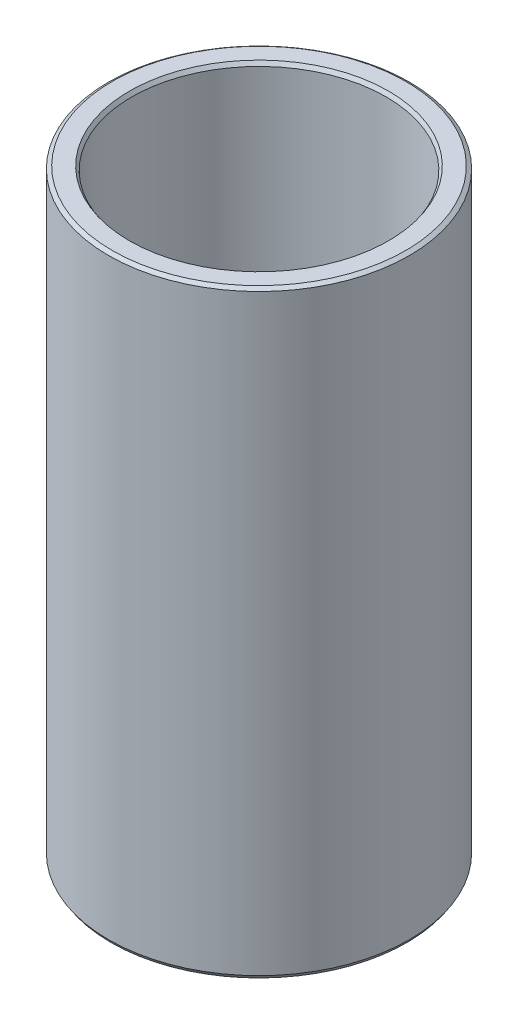
ISO-10303-21;
HEADER;
FILE_DESCRIPTION(('STEP AP214'),'2;1');
FILE_NAME('part.step','',(''),(''),'','','');
FILE_SCHEMA(('AUTOMOTIVE_DESIGN { 1 0 10303 214 1 1 1 1 }'));
ENDSEC;
DATA;
#1=APPLICATION_CONTEXT('core data for automotive mechanical design processes');
#2=APPLICATION_PROTOCOL_DEFINITION('international standard','automotive_design',2000,#1);
#3=PRODUCT_CONTEXT('',#1,'mechanical');
#4=PRODUCT('Part','Part','',(#3));
#5=PRODUCT_RELATED_PRODUCT_CATEGORY('part','',(#4));
#6=PRODUCT_DEFINITION_FORMATION('','',#4);
#7=PRODUCT_DEFINITION_CONTEXT('part definition',#1,'design');
#8=PRODUCT_DEFINITION('design','',#6,#7);
#9=PRODUCT_DEFINITION_SHAPE('','',#8);
#10=(LENGTH_UNIT() NAMED_UNIT(*) SI_UNIT(.MILLI.,.METRE.));
#11=(NAMED_UNIT(*) PLANE_ANGLE_UNIT() SI_UNIT($,.RADIAN.));
#12=(NAMED_UNIT(*) SI_UNIT($,.STERADIAN.) SOLID_ANGLE_UNIT());
#13=UNCERTAINTY_MEASURE_WITH_UNIT(LENGTH_MEASURE(1.E-05),#10,'distance_accuracy_value','');
#14=(GEOMETRIC_REPRESENTATION_CONTEXT(3) GLOBAL_UNCERTAINTY_ASSIGNED_CONTEXT((#13)) GLOBAL_UNIT_ASSIGNED_CONTEXT((#10,
#11,#12)) REPRESENTATION_CONTEXT('',''));
#15=CARTESIAN_POINT('',(0.,0.,0.));
#16=DIRECTION('',(0.,0.,1.));
#17=DIRECTION('',(1.,0.,0.));
#18=AXIS2_PLACEMENT_3D('',#15,#16,#17);
#19=CARTESIAN_POINT('',(0.,238.885693284538,0.));
#20=DIRECTION('',(0.,-1.,0.));
#21=DIRECTION('',(0.,0.,-1.));
#22=AXIS2_PLACEMENT_3D('',#19,#20,#21);
#23=CYLINDRICAL_SURFACE('',#22,60.);
#24=CARTESIAN_POINT('',(0.,1.49715635939934,0.));
#25=DIRECTION('',(0.,1.,0.));
#26=DIRECTION('',(0.,0.,1.));
#27=AXIS2_PLACEMENT_3D('',#24,#25,#26);
#28=CIRCLE('',#27,60.);
#29=CARTESIAN_POINT('',(0.,1.49715635939934,60.));
#30=VERTEX_POINT('',#29);
#31=EDGE_CURVE('E10',#30,#30,#28,.T.);
#32=ORIENTED_EDGE('',*,*,#31,.T.);
#33=EDGE_LOOP('',(#32));
#34=FACE_BOUND('',#33,.T.);
#35=CARTESIAN_POINT('',(0.,237.907163417209,0.));
#36=DIRECTION('',(0.,1.,0.));
#37=DIRECTION('',(0.,0.,1.));
#38=AXIS2_PLACEMENT_3D('',#35,#36,#37);
#39=CIRCLE('',#38,60.);
#40=CARTESIAN_POINT('',(0.,237.907163417209,60.));
#41=VERTEX_POINT('',#40);
#42=EDGE_CURVE('E50',#41,#41,#39,.F.);
#43=ORIENTED_EDGE('',*,*,#42,.T.);
#44=EDGE_LOOP('',(#43));
#45=FACE_BOUND('',#44,.T.);
#46=ADVANCED_FACE('F39',(#34,#45),#23,.T.);
#47=CARTESIAN_POINT('',(0.,238.885693284538,0.));
#48=DIRECTION('',(0.,1.,0.));
#49=DIRECTION('',(0.,0.,1.));
#50=AXIS2_PLACEMENT_3D('',#47,#48,#49);
#51=PLANE('',#50);
#52=CARTESIAN_POINT('',(0.,238.885693284538,0.));
#53=DIRECTION('',(0.,1.,0.));
#54=DIRECTION('',(0.,0.,1.));
#55=AXIS2_PLACEMENT_3D('',#52,#53,#54);
#56=CIRCLE('',#55,51.731943656874);
#57=CARTESIAN_POINT('',(0.,238.885693284538,51.731943656874));
#58=VERTEX_POINT('',#57);
#59=EDGE_CURVE('E58',#58,#58,#56,.F.);
#60=ORIENTED_EDGE('',*,*,#59,.T.);
#61=EDGE_LOOP('',(#60));
#62=FACE_BOUND('',#61,.T.);
#63=CARTESIAN_POINT('',(0.,238.885693284538,0.));
#64=DIRECTION('',(0.,1.,0.));
#65=DIRECTION('',(0.,0.,1.));
#66=AXIS2_PLACEMENT_3D('',#63,#64,#65);
#67=CIRCLE('',#66,58.5028436406007);
#68=CARTESIAN_POINT('',(0.,238.885693284538,58.5028436406007));
#69=VERTEX_POINT('',#68);
#70=EDGE_CURVE('E61',#69,#69,#67,.T.);
#71=ORIENTED_EDGE('',*,*,#70,.T.);
#72=EDGE_LOOP('',(#71));
#73=FACE_BOUND('',#72,.T.);
#74=ADVANCED_FACE('F88',(#62,#73),#51,.T.);
#75=CARTESIAN_POINT('',(0.,0.,0.));
#76=DIRECTION('',(0.,1.,0.));
#77=DIRECTION('',(0.,0.,1.));
#78=AXIS2_PLACEMENT_3D('',#75,#76,#77);
#79=PLANE('',#78);
#80=CARTESIAN_POINT('',(0.,0.,0.));
#81=DIRECTION('',(0.,1.,0.));
#82=DIRECTION('',(0.,0.,1.));
#83=AXIS2_PLACEMENT_3D('',#80,#81,#82);
#84=CIRCLE('',#83,52.2505701489443);
#85=CARTESIAN_POINT('',(0.,0.,52.2505701489443));
#86=VERTEX_POINT('',#85);
#87=EDGE_CURVE('E51',#86,#86,#84,.T.);
#88=ORIENTED_EDGE('',*,*,#87,.T.);
#89=EDGE_LOOP('',(#88));
#90=FACE_BOUND('',#89,.T.);
#91=CARTESIAN_POINT('',(0.,0.,0.));
#92=DIRECTION('',(0.,1.,0.));
#93=DIRECTION('',(0.,0.,1.));
#94=AXIS2_PLACEMENT_3D('',#91,#92,#93);
#95=CIRCLE('',#94,59.021470132671);
#96=CARTESIAN_POINT('',(0.,0.,59.021470132671));
#97=VERTEX_POINT('',#96);
#98=EDGE_CURVE('E54',#97,#97,#95,.F.);
#99=ORIENTED_EDGE('',*,*,#98,.T.);
#100=EDGE_LOOP('',(#99));
#101=FACE_BOUND('',#100,.T.);
#102=ADVANCED_FACE('F83',(#90,#101),#79,.F.);
#103=CARTESIAN_POINT('',(0.,238.885693284538,0.));
#104=DIRECTION('',(0.,-1.,0.));
#105=DIRECTION('',(0.,0.,-1.));
#106=AXIS2_PLACEMENT_3D('',#103,#104,#105);
#107=CYLINDRICAL_SURFACE('',#106,50.753413789545);
#108=CARTESIAN_POINT('',(0.,237.388536925139,0.));
#109=DIRECTION('',(0.,1.,0.));
#110=DIRECTION('',(0.,0.,1.));
#111=AXIS2_PLACEMENT_3D('',#108,#109,#110);
#112=CIRCLE('',#111,50.753413789545);
#113=CARTESIAN_POINT('',(0.,237.388536925139,50.753413789545));
#114=VERTEX_POINT('',#113);
#115=EDGE_CURVE('E67',#114,#114,#112,.T.);
#116=ORIENTED_EDGE('',*,*,#115,.T.);
#117=EDGE_LOOP('',(#116));
#118=FACE_BOUND('',#117,.T.);
#119=CARTESIAN_POINT('',(0.,0.978529867328964,0.));
#120=DIRECTION('',(0.,1.,0.));
#121=DIRECTION('',(0.,0.,1.));
#122=AXIS2_PLACEMENT_3D('',#119,#120,#121);
#123=CIRCLE('',#122,50.753413789545);
#124=CARTESIAN_POINT('',(0.,0.978529867328964,50.753413789545));
#125=VERTEX_POINT('',#124);
#126=EDGE_CURVE('E69',#125,#125,#123,.F.);
#127=ORIENTED_EDGE('',*,*,#126,.T.);
#128=EDGE_LOOP('',(#127));
#129=FACE_BOUND('',#128,.T.);
#130=ADVANCED_FACE('F71',(#118,#129),#107,.F.);
#131=CARTESIAN_POINT('',(0.,237.388536925139,0.));
#132=DIRECTION('',(0.,1.,0.));
#133=DIRECTION('',(0.,0.,1.));
#134=AXIS2_PLACEMENT_3D('',#131,#132,#133);
#135=CONICAL_SURFACE('',#134,50.753413789545,0.578896418966708);
#136=ORIENTED_EDGE('',*,*,#59,.F.);
#137=EDGE_LOOP('',(#136));
#138=FACE_BOUND('',#137,.T.);
#139=ORIENTED_EDGE('',*,*,#115,.F.);
#140=EDGE_LOOP('',(#139));
#141=FACE_BOUND('',#140,.T.);
#142=ADVANCED_FACE('F77',(#138,#141),#135,.F.);
#143=CARTESIAN_POINT('',(0.,0.,0.));
#144=DIRECTION('',(0.,-1.,0.));
#145=DIRECTION('',(0.,0.,-1.));
#146=AXIS2_PLACEMENT_3D('',#143,#144,#145);
#147=CONICAL_SURFACE('',#146,52.2505701489443,0.991899907828197);
#148=ORIENTED_EDGE('',*,*,#126,.F.);
#149=EDGE_LOOP('',(#148));
#150=FACE_BOUND('',#149,.T.);
#151=ORIENTED_EDGE('',*,*,#87,.F.);
#152=EDGE_LOOP('',(#151));
#153=FACE_BOUND('',#152,.T.);
#154=ADVANCED_FACE('F73',(#150,#153),#147,.F.);
#155=CARTESIAN_POINT('',(0.,1.49715635939934,0.));
#156=DIRECTION('',(0.,1.,0.));
#157=DIRECTION('',(0.,0.,1.));
#158=AXIS2_PLACEMENT_3D('',#155,#156,#157);
#159=CONICAL_SURFACE('',#158,60.,0.578896418966695);
#160=ORIENTED_EDGE('',*,*,#98,.F.);
#161=EDGE_LOOP('',(#160));
#162=FACE_BOUND('',#161,.T.);
#163=ORIENTED_EDGE('',*,*,#31,.F.);
#164=EDGE_LOOP('',(#163));
#165=FACE_BOUND('',#164,.T.);
#166=ADVANCED_FACE('F76',(#162,#165),#159,.T.);
#167=CARTESIAN_POINT('',(0.,238.885693284538,0.));
#168=DIRECTION('',(0.,-1.,0.));
#169=DIRECTION('',(0.,0.,-1.));
#170=AXIS2_PLACEMENT_3D('',#167,#168,#169);
#171=CONICAL_SURFACE('',#170,58.5028436406007,0.991899907828206);
#172=ORIENTED_EDGE('',*,*,#42,.F.);
#173=EDGE_LOOP('',(#172));
#174=FACE_BOUND('',#173,.T.);
#175=ORIENTED_EDGE('',*,*,#70,.F.);
#176=EDGE_LOOP('',(#175));
#177=FACE_BOUND('',#176,.T.);
#178=ADVANCED_FACE('F45',(#174,#177),#171,.T.);
#179=CLOSED_SHELL('',(#46,#74,#102,#130,#142,#154,#166,#178));
#180=MANIFOLD_SOLID_BREP('B2',#179);
#181=ADVANCED_BREP_SHAPE_REPRESENTATION('',(#18,#180),#14);
#182=SHAPE_DEFINITION_REPRESENTATION(#9,#181);
ENDSEC;
END-ISO-10303-21;
